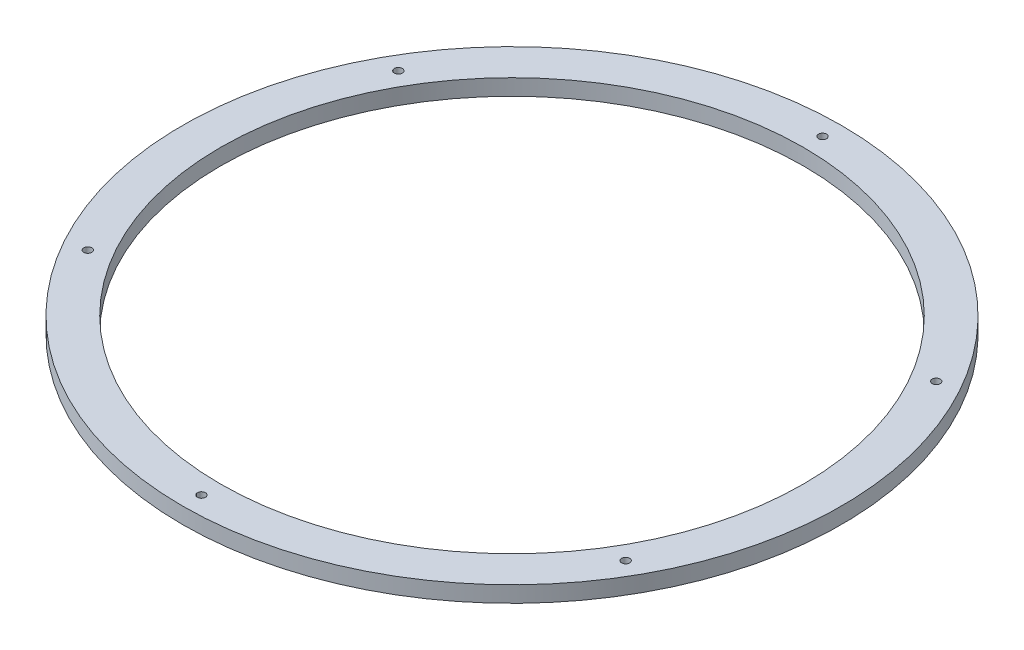
ISO-10303-21;
HEADER;
FILE_DESCRIPTION(('STEP AP214'),'2;1');
FILE_NAME('part.step','',(''),(''),'','','');
FILE_SCHEMA(('AUTOMOTIVE_DESIGN { 1 0 10303 214 1 1 1 1 }'));
ENDSEC;
DATA;
#1=APPLICATION_CONTEXT('core data for automotive mechanical design processes');
#2=APPLICATION_PROTOCOL_DEFINITION('international standard','automotive_design',2000,#1);
#3=PRODUCT_CONTEXT('',#1,'mechanical');
#4=PRODUCT('Part','Part','',(#3));
#5=PRODUCT_RELATED_PRODUCT_CATEGORY('part','',(#4));
#6=PRODUCT_DEFINITION_FORMATION('','',#4);
#7=PRODUCT_DEFINITION_CONTEXT('part definition',#1,'design');
#8=PRODUCT_DEFINITION('design','',#6,#7);
#9=PRODUCT_DEFINITION_SHAPE('','',#8);
#10=(LENGTH_UNIT() NAMED_UNIT(*) SI_UNIT(.MILLI.,.METRE.));
#11=(NAMED_UNIT(*) PLANE_ANGLE_UNIT() SI_UNIT($,.RADIAN.));
#12=(NAMED_UNIT(*) SI_UNIT($,.STERADIAN.) SOLID_ANGLE_UNIT());
#13=UNCERTAINTY_MEASURE_WITH_UNIT(LENGTH_MEASURE(1.E-05),#10,'distance_accuracy_value','');
#14=(GEOMETRIC_REPRESENTATION_CONTEXT(3) GLOBAL_UNCERTAINTY_ASSIGNED_CONTEXT((#13)) GLOBAL_UNIT_ASSIGNED_CONTEXT((#10,
#11,#12)) REPRESENTATION_CONTEXT('',''));
#15=CARTESIAN_POINT('',(0.,0.,0.));
#16=DIRECTION('',(0.,0.,1.));
#17=DIRECTION('',(1.,0.,0.));
#18=AXIS2_PLACEMENT_3D('',#15,#16,#17);
#19=CARTESIAN_POINT('',(0.,6.35,0.));
#20=DIRECTION('',(0.,-1.,0.));
#21=DIRECTION('',(0.,0.,-1.));
#22=AXIS2_PLACEMENT_3D('',#19,#20,#21);
#23=CYLINDRICAL_SURFACE('',#22,115.);
#24=CARTESIAN_POINT('',(0.,6.35,0.));
#25=DIRECTION('',(0.,1.,0.));
#26=DIRECTION('',(0.,0.,1.));
#27=AXIS2_PLACEMENT_3D('',#24,#25,#26);
#28=CIRCLE('',#27,115.);
#29=CARTESIAN_POINT('',(0.,6.35,115.));
#30=VERTEX_POINT('',#29);
#31=EDGE_CURVE('E41',#30,#30,#28,.T.);
#32=ORIENTED_EDGE('',*,*,#31,.T.);
#33=EDGE_LOOP('',(#32));
#34=FACE_BOUND('',#33,.T.);
#35=CARTESIAN_POINT('',(0.,0.,0.));
#36=DIRECTION('',(0.,1.,0.));
#37=DIRECTION('',(0.,0.,1.));
#38=AXIS2_PLACEMENT_3D('',#35,#36,#37);
#39=CIRCLE('',#38,115.);
#40=CARTESIAN_POINT('',(0.,0.,115.));
#41=VERTEX_POINT('',#40);
#42=EDGE_CURVE('E67',#41,#41,#39,.T.);
#43=ORIENTED_EDGE('',*,*,#42,.F.);
#44=EDGE_LOOP('',(#43));
#45=FACE_BOUND('',#44,.T.);
#46=ADVANCED_FACE('F33',(#34,#45),#23,.F.);
#47=CARTESIAN_POINT('',(0.,6.35,-122.5));
#48=DIRECTION('',(0.,-1.,0.));
#49=DIRECTION('',(0.,0.,-1.));
#50=AXIS2_PLACEMENT_3D('',#47,#48,#49);
#51=CYLINDRICAL_SURFACE('',#50,1.5875);
#52=CARTESIAN_POINT('',(0.,6.35,-122.5));
#53=DIRECTION('',(0.,1.,0.));
#54=DIRECTION('',(0.,0.,1.));
#55=AXIS2_PLACEMENT_3D('',#52,#53,#54);
#56=CIRCLE('',#55,1.5875);
#57=CARTESIAN_POINT('',(0.,6.35,-120.9125));
#58=VERTEX_POINT('',#57);
#59=EDGE_CURVE('E46',#58,#58,#56,.T.);
#60=ORIENTED_EDGE('',*,*,#59,.T.);
#61=EDGE_LOOP('',(#60));
#62=FACE_BOUND('',#61,.T.);
#63=CARTESIAN_POINT('',(0.,0.,-122.5));
#64=DIRECTION('',(0.,1.,0.));
#65=DIRECTION('',(0.,0.,1.));
#66=AXIS2_PLACEMENT_3D('',#63,#64,#65);
#67=CIRCLE('',#66,1.5875);
#68=CARTESIAN_POINT('',(0.,0.,-120.9125));
#69=VERTEX_POINT('',#68);
#70=EDGE_CURVE('E65',#69,#69,#67,.T.);
#71=ORIENTED_EDGE('',*,*,#70,.F.);
#72=EDGE_LOOP('',(#71));
#73=FACE_BOUND('',#72,.T.);
#74=ADVANCED_FACE('F94',(#62,#73),#51,.F.);
#75=CARTESIAN_POINT('',(106.088111963596,6.35,-61.2500000000036));
#76=DIRECTION('',(0.,-1.,0.));
#77=DIRECTION('',(0.,0.,-1.));
#78=AXIS2_PLACEMENT_3D('',#75,#76,#77);
#79=CYLINDRICAL_SURFACE('',#78,1.58749999999999);
#80=CARTESIAN_POINT('',(106.088111963596,6.35,-61.2500000000036));
#81=DIRECTION('',(0.,1.,0.));
#82=DIRECTION('',(0.,0.,1.));
#83=AXIS2_PLACEMENT_3D('',#80,#81,#82);
#84=CIRCLE('',#83,1.58749999999999);
#85=CARTESIAN_POINT('',(106.088111963596,6.35,-59.6625000000036));
#86=VERTEX_POINT('',#85);
#87=EDGE_CURVE('E89',#86,#86,#84,.T.);
#88=ORIENTED_EDGE('',*,*,#87,.T.);
#89=EDGE_LOOP('',(#88));
#90=FACE_BOUND('',#89,.T.);
#91=CARTESIAN_POINT('',(106.088111963596,0.,-61.2500000000036));
#92=DIRECTION('',(0.,1.,0.));
#93=DIRECTION('',(0.,0.,1.));
#94=AXIS2_PLACEMENT_3D('',#91,#92,#93);
#95=CIRCLE('',#94,1.58749999999999);
#96=CARTESIAN_POINT('',(106.088111963596,0.,-59.6625000000036));
#97=VERTEX_POINT('',#96);
#98=EDGE_CURVE('E62',#97,#97,#95,.T.);
#99=ORIENTED_EDGE('',*,*,#98,.F.);
#100=EDGE_LOOP('',(#99));
#101=FACE_BOUND('',#100,.T.);
#102=ADVANCED_FACE('F112',(#90,#101),#79,.F.);
#103=CARTESIAN_POINT('',(106.0881119636,6.35,61.2499999999964));
#104=DIRECTION('',(0.,-1.,0.));
#105=DIRECTION('',(0.,0.,-1.));
#106=AXIS2_PLACEMENT_3D('',#103,#104,#105);
#107=CYLINDRICAL_SURFACE('',#106,1.58749999999999);
#108=CARTESIAN_POINT('',(106.0881119636,6.35,61.2499999999964));
#109=DIRECTION('',(0.,1.,0.));
#110=DIRECTION('',(0.,0.,1.));
#111=AXIS2_PLACEMENT_3D('',#108,#109,#110);
#112=CIRCLE('',#111,1.58749999999999);
#113=CARTESIAN_POINT('',(106.0881119636,6.35,62.8374999999964));
#114=VERTEX_POINT('',#113);
#115=EDGE_CURVE('E86',#114,#114,#112,.T.);
#116=ORIENTED_EDGE('',*,*,#115,.T.);
#117=EDGE_LOOP('',(#116));
#118=FACE_BOUND('',#117,.T.);
#119=CARTESIAN_POINT('',(106.0881119636,0.,61.2499999999964));
#120=DIRECTION('',(0.,1.,0.));
#121=DIRECTION('',(0.,0.,1.));
#122=AXIS2_PLACEMENT_3D('',#119,#120,#121);
#123=CIRCLE('',#122,1.58749999999999);
#124=CARTESIAN_POINT('',(106.0881119636,0.,62.8374999999964));
#125=VERTEX_POINT('',#124);
#126=EDGE_CURVE('E59',#125,#125,#123,.T.);
#127=ORIENTED_EDGE('',*,*,#126,.F.);
#128=EDGE_LOOP('',(#127));
#129=FACE_BOUND('',#128,.T.);
#130=ADVANCED_FACE('F119',(#118,#129),#107,.F.);
#131=CARTESIAN_POINT('',(8.23066159022526E-12,6.35,122.5));
#132=DIRECTION('',(0.,-1.,0.));
#133=DIRECTION('',(0.,0.,-1.));
#134=AXIS2_PLACEMENT_3D('',#131,#132,#133);
#135=CYLINDRICAL_SURFACE('',#134,1.5875);
#136=CARTESIAN_POINT('',(8.23066159022526E-12,6.35,122.5));
#137=DIRECTION('',(0.,1.,0.));
#138=DIRECTION('',(0.,0.,1.));
#139=AXIS2_PLACEMENT_3D('',#136,#137,#138);
#140=CIRCLE('',#139,1.5875);
#141=CARTESIAN_POINT('',(8.23066159022526E-12,6.35,124.0875));
#142=VERTEX_POINT('',#141);
#143=EDGE_CURVE('E81',#142,#142,#140,.T.);
#144=ORIENTED_EDGE('',*,*,#143,.T.);
#145=EDGE_LOOP('',(#144));
#146=FACE_BOUND('',#145,.T.);
#147=CARTESIAN_POINT('',(8.23066159022526E-12,0.,122.5));
#148=DIRECTION('',(0.,1.,0.));
#149=DIRECTION('',(0.,0.,1.));
#150=AXIS2_PLACEMENT_3D('',#147,#148,#149);
#151=CIRCLE('',#150,1.5875);
#152=CARTESIAN_POINT('',(8.23066159022526E-12,0.,124.0875));
#153=VERTEX_POINT('',#152);
#154=EDGE_CURVE('E56',#153,#153,#151,.T.);
#155=ORIENTED_EDGE('',*,*,#154,.F.);
#156=EDGE_LOOP('',(#155));
#157=FACE_BOUND('',#156,.T.);
#158=ADVANCED_FACE('F123',(#146,#157),#135,.F.);
#159=CARTESIAN_POINT('',(-106.088111963588,6.35,61.2500000000036));
#160=DIRECTION('',(0.,-1.,0.));
#161=DIRECTION('',(0.,0.,-1.));
#162=AXIS2_PLACEMENT_3D('',#159,#160,#161);
#163=CYLINDRICAL_SURFACE('',#162,1.58749999999999);
#164=CARTESIAN_POINT('',(-106.088111963588,6.35,61.2500000000036));
#165=DIRECTION('',(0.,1.,0.));
#166=DIRECTION('',(0.,0.,1.));
#167=AXIS2_PLACEMENT_3D('',#164,#165,#166);
#168=CIRCLE('',#167,1.58749999999999);
#169=CARTESIAN_POINT('',(-106.088111963588,6.35,62.8375000000036));
#170=VERTEX_POINT('',#169);
#171=EDGE_CURVE('E76',#170,#170,#168,.T.);
#172=ORIENTED_EDGE('',*,*,#171,.T.);
#173=EDGE_LOOP('',(#172));
#174=FACE_BOUND('',#173,.T.);
#175=CARTESIAN_POINT('',(-106.088111963588,0.,61.2500000000036));
#176=DIRECTION('',(0.,1.,0.));
#177=DIRECTION('',(0.,0.,1.));
#178=AXIS2_PLACEMENT_3D('',#175,#176,#177);
#179=CIRCLE('',#178,1.58749999999999);
#180=CARTESIAN_POINT('',(-106.088111963588,0.,62.8375000000036));
#181=VERTEX_POINT('',#180);
#182=EDGE_CURVE('E53',#181,#181,#179,.T.);
#183=ORIENTED_EDGE('',*,*,#182,.F.);
#184=EDGE_LOOP('',(#183));
#185=FACE_BOUND('',#184,.T.);
#186=ADVANCED_FACE('F126',(#174,#185),#163,.F.);
#187=CARTESIAN_POINT('',(-106.088111963592,6.35,-61.2499999999964));
#188=DIRECTION('',(0.,-1.,0.));
#189=DIRECTION('',(0.,0.,-1.));
#190=AXIS2_PLACEMENT_3D('',#187,#188,#189);
#191=CYLINDRICAL_SURFACE('',#190,1.5875);
#192=CARTESIAN_POINT('',(-106.088111963592,6.35,-61.2499999999964));
#193=DIRECTION('',(0.,1.,0.));
#194=DIRECTION('',(0.,0.,1.));
#195=AXIS2_PLACEMENT_3D('',#192,#193,#194);
#196=CIRCLE('',#195,1.5875);
#197=CARTESIAN_POINT('',(-106.088111963592,6.35,-59.6624999999964));
#198=VERTEX_POINT('',#197);
#199=EDGE_CURVE('E72',#198,#198,#196,.T.);
#200=ORIENTED_EDGE('',*,*,#199,.T.);
#201=EDGE_LOOP('',(#200));
#202=FACE_BOUND('',#201,.T.);
#203=CARTESIAN_POINT('',(-106.088111963592,0.,-61.2499999999964));
#204=DIRECTION('',(0.,1.,0.));
#205=DIRECTION('',(0.,0.,1.));
#206=AXIS2_PLACEMENT_3D('',#203,#204,#205);
#207=CIRCLE('',#206,1.5875);
#208=CARTESIAN_POINT('',(-106.088111963592,0.,-59.6624999999964));
#209=VERTEX_POINT('',#208);
#210=EDGE_CURVE('E50',#209,#209,#207,.T.);
#211=ORIENTED_EDGE('',*,*,#210,.F.);
#212=EDGE_LOOP('',(#211));
#213=FACE_BOUND('',#212,.T.);
#214=ADVANCED_FACE('F35',(#202,#213),#191,.F.);
#215=CARTESIAN_POINT('',(0.,6.35,0.));
#216=DIRECTION('',(0.,-1.,0.));
#217=DIRECTION('',(0.,0.,-1.));
#218=AXIS2_PLACEMENT_3D('',#215,#216,#217);
#219=CYLINDRICAL_SURFACE('',#218,130.);
#220=CARTESIAN_POINT('',(0.,6.35,0.));
#221=DIRECTION('',(0.,1.,0.));
#222=DIRECTION('',(0.,0.,1.));
#223=AXIS2_PLACEMENT_3D('',#220,#221,#222);
#224=CIRCLE('',#223,130.);
#225=CARTESIAN_POINT('',(0.,6.35,130.));
#226=VERTEX_POINT('',#225);
#227=EDGE_CURVE('E10',#226,#226,#224,.T.);
#228=ORIENTED_EDGE('',*,*,#227,.F.);
#229=EDGE_LOOP('',(#228));
#230=FACE_BOUND('',#229,.T.);
#231=CARTESIAN_POINT('',(0.,0.,0.));
#232=DIRECTION('',(0.,1.,0.));
#233=DIRECTION('',(0.,0.,1.));
#234=AXIS2_PLACEMENT_3D('',#231,#232,#233);
#235=CIRCLE('',#234,130.);
#236=CARTESIAN_POINT('',(0.,0.,130.));
#237=VERTEX_POINT('',#236);
#238=EDGE_CURVE('E37',#237,#237,#235,.T.);
#239=ORIENTED_EDGE('',*,*,#238,.T.);
#240=EDGE_LOOP('',(#239));
#241=FACE_BOUND('',#240,.T.);
#242=ADVANCED_FACE('F101',(#230,#241),#219,.T.);
#243=CARTESIAN_POINT('',(0.,6.35,0.));
#244=DIRECTION('',(0.,1.,0.));
#245=DIRECTION('',(0.,0.,1.));
#246=AXIS2_PLACEMENT_3D('',#243,#244,#245);
#247=PLANE('',#246);
#248=ORIENTED_EDGE('',*,*,#199,.F.);
#249=EDGE_LOOP('',(#248));
#250=FACE_BOUND('',#249,.T.);
#251=ORIENTED_EDGE('',*,*,#171,.F.);
#252=EDGE_LOOP('',(#251));
#253=FACE_BOUND('',#252,.T.);
#254=ORIENTED_EDGE('',*,*,#143,.F.);
#255=EDGE_LOOP('',(#254));
#256=FACE_BOUND('',#255,.T.);
#257=ORIENTED_EDGE('',*,*,#115,.F.);
#258=EDGE_LOOP('',(#257));
#259=FACE_BOUND('',#258,.T.);
#260=ORIENTED_EDGE('',*,*,#87,.F.);
#261=EDGE_LOOP('',(#260));
#262=FACE_BOUND('',#261,.T.);
#263=ORIENTED_EDGE('',*,*,#59,.F.);
#264=EDGE_LOOP('',(#263));
#265=FACE_BOUND('',#264,.T.);
#266=ORIENTED_EDGE('',*,*,#31,.F.);
#267=EDGE_LOOP('',(#266));
#268=FACE_BOUND('',#267,.T.);
#269=ORIENTED_EDGE('',*,*,#227,.T.);
#270=EDGE_LOOP('',(#269));
#271=FACE_BOUND('',#270,.T.);
#272=ADVANCED_FACE('F97',(#250,#253,#256,#259,#262,#265,#268,#271),#247,.T.);
#273=CARTESIAN_POINT('',(0.,0.,0.));
#274=DIRECTION('',(0.,1.,0.));
#275=DIRECTION('',(0.,0.,1.));
#276=AXIS2_PLACEMENT_3D('',#273,#274,#275);
#277=PLANE('',#276);
#278=ORIENTED_EDGE('',*,*,#210,.T.);
#279=EDGE_LOOP('',(#278));
#280=FACE_BOUND('',#279,.T.);
#281=ORIENTED_EDGE('',*,*,#182,.T.);
#282=EDGE_LOOP('',(#281));
#283=FACE_BOUND('',#282,.T.);
#284=ORIENTED_EDGE('',*,*,#154,.T.);
#285=EDGE_LOOP('',(#284));
#286=FACE_BOUND('',#285,.T.);
#287=ORIENTED_EDGE('',*,*,#126,.T.);
#288=EDGE_LOOP('',(#287));
#289=FACE_BOUND('',#288,.T.);
#290=ORIENTED_EDGE('',*,*,#98,.T.);
#291=EDGE_LOOP('',(#290));
#292=FACE_BOUND('',#291,.T.);
#293=ORIENTED_EDGE('',*,*,#70,.T.);
#294=EDGE_LOOP('',(#293));
#295=FACE_BOUND('',#294,.T.);
#296=ORIENTED_EDGE('',*,*,#42,.T.);
#297=EDGE_LOOP('',(#296));
#298=FACE_BOUND('',#297,.T.);
#299=ORIENTED_EDGE('',*,*,#238,.F.);
#300=EDGE_LOOP('',(#299));
#301=FACE_BOUND('',#300,.T.);
#302=ADVANCED_FACE('F100',(#280,#283,#286,#289,#292,#295,#298,#301),#277,.F.);
#303=CLOSED_SHELL('',(#46,#74,#102,#130,#158,#186,#214,#242,#272,#302));
#304=MANIFOLD_SOLID_BREP('B2',#303);
#305=ADVANCED_BREP_SHAPE_REPRESENTATION('',(#18,#304),#14);
#306=SHAPE_DEFINITION_REPRESENTATION(#9,#305);
ENDSEC;
END-ISO-10303-21;
